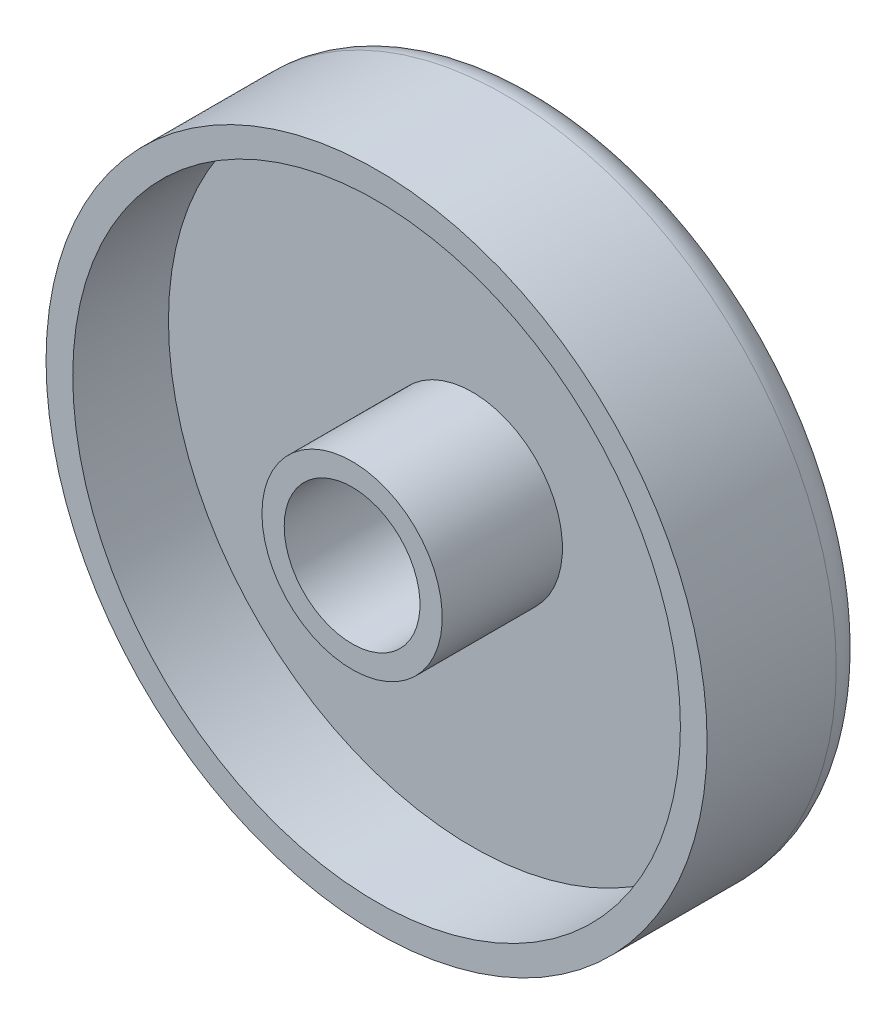
ISO-10303-21;
HEADER;
FILE_DESCRIPTION(('STEP AP214'),'2;1');
FILE_NAME('part.step','',(''),(''),'','','');
FILE_SCHEMA(('AUTOMOTIVE_DESIGN { 1 0 10303 214 1 1 1 1 }'));
ENDSEC;
DATA;
#1=APPLICATION_CONTEXT('core data for automotive mechanical design processes');
#2=APPLICATION_PROTOCOL_DEFINITION('international standard','automotive_design',2000,#1);
#3=PRODUCT_CONTEXT('',#1,'mechanical');
#4=PRODUCT('Part','Part','',(#3));
#5=PRODUCT_RELATED_PRODUCT_CATEGORY('part','',(#4));
#6=PRODUCT_DEFINITION_FORMATION('','',#4);
#7=PRODUCT_DEFINITION_CONTEXT('part definition',#1,'design');
#8=PRODUCT_DEFINITION('design','',#6,#7);
#9=PRODUCT_DEFINITION_SHAPE('','',#8);
#10=(LENGTH_UNIT() NAMED_UNIT(*) SI_UNIT(.MILLI.,.METRE.));
#11=(NAMED_UNIT(*) PLANE_ANGLE_UNIT() SI_UNIT($,.RADIAN.));
#12=(NAMED_UNIT(*) SI_UNIT($,.STERADIAN.) SOLID_ANGLE_UNIT());
#13=UNCERTAINTY_MEASURE_WITH_UNIT(LENGTH_MEASURE(1.E-05),#10,'distance_accuracy_value','');
#14=(GEOMETRIC_REPRESENTATION_CONTEXT(3) GLOBAL_UNCERTAINTY_ASSIGNED_CONTEXT((#13)) GLOBAL_UNIT_ASSIGNED_CONTEXT((#10,
#11,#12)) REPRESENTATION_CONTEXT('',''));
#15=CARTESIAN_POINT('',(0.,0.,0.));
#16=DIRECTION('',(0.,0.,1.));
#17=DIRECTION('',(1.,0.,0.));
#18=AXIS2_PLACEMENT_3D('',#15,#16,#17);
#19=CARTESIAN_POINT('',(0.,0.,7.3));
#20=DIRECTION('',(0.,0.,1.));
#21=DIRECTION('',(1.,0.,0.));
#22=AXIS2_PLACEMENT_3D('',#19,#20,#21);
#23=PLANE('',#22);
#24=CARTESIAN_POINT('',(0.,0.,7.3));
#25=DIRECTION('',(0.,0.,-1.));
#26=DIRECTION('',(1.,0.,0.));
#27=AXIS2_PLACEMENT_3D('',#24,#25,#26);
#28=CIRCLE('',#27,13.65);
#29=CARTESIAN_POINT('',(-13.65,0.,7.3));
#30=VERTEX_POINT('',#29);
#31=EDGE_CURVE('E20',#30,#30,#28,.T.);
#32=ORIENTED_EDGE('',*,*,#31,.T.);
#33=EDGE_LOOP('',(#32));
#34=FACE_BOUND('',#33,.T.);
#35=CARTESIAN_POINT('',(0.,0.,7.3));
#36=DIRECTION('',(0.,0.,1.));
#37=DIRECTION('',(1.,0.,0.));
#38=AXIS2_PLACEMENT_3D('',#35,#36,#37);
#39=CIRCLE('',#38,14.85);
#40=CARTESIAN_POINT('',(-14.85,0.,7.3));
#41=VERTEX_POINT('',#40);
#42=EDGE_CURVE('E110',#41,#41,#39,.T.);
#43=ORIENTED_EDGE('',*,*,#42,.T.);
#44=EDGE_LOOP('',(#43));
#45=FACE_BOUND('',#44,.T.);
#46=ADVANCED_FACE('F16',(#34,#45),#23,.T.);
#47=CARTESIAN_POINT('',(0.,0.,8.4));
#48=DIRECTION('',(0.,0.,1.));
#49=DIRECTION('',(1.,0.,0.));
#50=AXIS2_PLACEMENT_3D('',#47,#48,#49);
#51=PLANE('',#50);
#52=CARTESIAN_POINT('',(0.,0.,8.4));
#53=DIRECTION('',(0.,0.,-1.));
#54=DIRECTION('',(1.,0.,0.));
#55=AXIS2_PLACEMENT_3D('',#52,#53,#54);
#56=CIRCLE('',#55,3.05);
#57=CARTESIAN_POINT('',(-3.05,0.,8.4));
#58=VERTEX_POINT('',#57);
#59=EDGE_CURVE('E88',#58,#58,#56,.T.);
#60=ORIENTED_EDGE('',*,*,#59,.T.);
#61=EDGE_LOOP('',(#60));
#62=FACE_BOUND('',#61,.T.);
#63=CARTESIAN_POINT('',(0.,0.,8.4));
#64=DIRECTION('',(0.,0.,1.));
#65=DIRECTION('',(1.,0.,0.));
#66=AXIS2_PLACEMENT_3D('',#63,#64,#65);
#67=CIRCLE('',#66,4.05);
#68=CARTESIAN_POINT('',(-4.05,0.,8.4));
#69=VERTEX_POINT('',#68);
#70=EDGE_CURVE('E27',#69,#69,#67,.T.);
#71=ORIENTED_EDGE('',*,*,#70,.T.);
#72=EDGE_LOOP('',(#71));
#73=FACE_BOUND('',#72,.T.);
#74=ADVANCED_FACE('F160',(#62,#73),#51,.T.);
#75=CARTESIAN_POINT('',(0.,0.,0.));
#76=DIRECTION('',(0.,0.,1.));
#77=DIRECTION('',(1.,0.,0.));
#78=AXIS2_PLACEMENT_3D('',#75,#76,#77);
#79=CYLINDRICAL_SURFACE('',#78,4.05);
#80=ORIENTED_EDGE('',*,*,#70,.F.);
#81=DIRECTION('',(0.,0.,-1.));
#82=VECTOR('',#81,1.);
#83=CARTESIAN_POINT('',(-4.05,0.,0.));
#84=LINE('',#83,#82);
#85=CARTESIAN_POINT('',(-4.05,0.,3.));
#86=VERTEX_POINT('',#85);
#87=EDGE_CURVE('E11',#69,#86,#84,.T.);
#88=ORIENTED_EDGE('',*,*,#87,.T.);
#89=CARTESIAN_POINT('',(0.,0.,3.));
#90=DIRECTION('',(0.,0.,1.));
#91=DIRECTION('',(1.,0.,0.));
#92=AXIS2_PLACEMENT_3D('',#89,#90,#91);
#93=CIRCLE('',#92,4.05);
#94=EDGE_CURVE('E81',#86,#86,#93,.T.);
#95=ORIENTED_EDGE('',*,*,#94,.T.);
#96=ORIENTED_EDGE('',*,*,#87,.F.);
#97=EDGE_LOOP('',(#80,#88,#95,#96));
#98=FACE_BOUND('',#97,.T.);
#99=ADVANCED_FACE('F189',(#98),#79,.T.);
#100=CARTESIAN_POINT('',(0.,0.,2.6));
#101=DIRECTION('',(0.,0.,1.));
#102=DIRECTION('',(1.,0.,0.));
#103=AXIS2_PLACEMENT_3D('',#100,#101,#102);
#104=PLANE('',#103);
#105=CARTESIAN_POINT('',(0.,0.,2.6));
#106=DIRECTION('',(0.,0.,-1.));
#107=DIRECTION('',(1.,0.,0.));
#108=AXIS2_PLACEMENT_3D('',#105,#106,#107);
#109=CIRCLE('',#108,3.05);
#110=CARTESIAN_POINT('',(-3.05,0.,2.6));
#111=VERTEX_POINT('',#110);
#112=EDGE_CURVE('E276',#111,#111,#109,.T.);
#113=ORIENTED_EDGE('',*,*,#112,.F.);
#114=EDGE_LOOP('',(#113));
#115=FACE_BOUND('',#114,.T.);
#116=ADVANCED_FACE('F179',(#115),#104,.T.);
#117=CARTESIAN_POINT('',(0.,0.,8.4));
#118=DIRECTION('',(0.,0.,-1.));
#119=DIRECTION('',(1.,0.,0.));
#120=AXIS2_PLACEMENT_3D('',#117,#118,#119);
#121=CYLINDRICAL_SURFACE('',#120,3.05);
#122=ORIENTED_EDGE('',*,*,#59,.F.);
#123=DIRECTION('',(0.,0.,-1.));
#124=VECTOR('',#123,1.);
#125=CARTESIAN_POINT('',(-3.05,0.,8.4));
#126=LINE('',#125,#124);
#127=EDGE_CURVE('E127',#58,#111,#126,.T.);
#128=ORIENTED_EDGE('',*,*,#127,.T.);
#129=ORIENTED_EDGE('',*,*,#112,.T.);
#130=ORIENTED_EDGE('',*,*,#127,.F.);
#131=EDGE_LOOP('',(#122,#128,#129,#130));
#132=FACE_BOUND('',#131,.T.);
#133=ADVANCED_FACE('F173',(#132),#121,.F.);
#134=CARTESIAN_POINT('',(0.,0.,3.));
#135=DIRECTION('',(0.,0.,1.));
#136=DIRECTION('',(1.,0.,0.));
#137=AXIS2_PLACEMENT_3D('',#134,#135,#136);
#138=PLANE('',#137);
#139=ORIENTED_EDGE('',*,*,#94,.F.);
#140=EDGE_LOOP('',(#139));
#141=FACE_BOUND('',#140,.T.);
#142=CARTESIAN_POINT('',(0.,0.,3.));
#143=DIRECTION('',(0.,0.,-1.));
#144=DIRECTION('',(1.,0.,0.));
#145=AXIS2_PLACEMENT_3D('',#142,#143,#144);
#146=CIRCLE('',#145,13.65);
#147=CARTESIAN_POINT('',(-13.65,0.,3.));
#148=VERTEX_POINT('',#147);
#149=EDGE_CURVE('E74',#148,#148,#146,.T.);
#150=ORIENTED_EDGE('',*,*,#149,.F.);
#151=EDGE_LOOP('',(#150));
#152=FACE_BOUND('',#151,.T.);
#153=ADVANCED_FACE('F178',(#141,#152),#138,.T.);
#154=CARTESIAN_POINT('',(0.,0.,8.4));
#155=DIRECTION('',(0.,0.,-1.));
#156=DIRECTION('',(1.,0.,0.));
#157=AXIS2_PLACEMENT_3D('',#154,#155,#156);
#158=CYLINDRICAL_SURFACE('',#157,13.65);
#159=ORIENTED_EDGE('',*,*,#31,.F.);
#160=DIRECTION('',(0.,0.,-1.));
#161=VECTOR('',#160,1.);
#162=CARTESIAN_POINT('',(-13.65,0.,8.4));
#163=LINE('',#162,#161);
#164=EDGE_CURVE('E77',#30,#148,#163,.T.);
#165=ORIENTED_EDGE('',*,*,#164,.T.);
#166=ORIENTED_EDGE('',*,*,#149,.T.);
#167=ORIENTED_EDGE('',*,*,#164,.F.);
#168=EDGE_LOOP('',(#159,#165,#166,#167));
#169=FACE_BOUND('',#168,.T.);
#170=ADVANCED_FACE('F76',(#169),#158,.F.);
#171=CARTESIAN_POINT('',(0.,0.,1.3));
#172=DIRECTION('',(0.,0.,1.));
#173=DIRECTION('',(1.,0.,0.));
#174=AXIS2_PLACEMENT_3D('',#171,#172,#173);
#175=PLANE('',#174);
#176=CARTESIAN_POINT('',(0.,0.,1.3));
#177=DIRECTION('',(0.,0.,1.));
#178=DIRECTION('',(1.,0.,0.));
#179=AXIS2_PLACEMENT_3D('',#176,#177,#178);
#180=CIRCLE('',#179,9.75);
#181=CARTESIAN_POINT('',(-9.75,0.,1.3));
#182=VERTEX_POINT('',#181);
#183=EDGE_CURVE('E100',#182,#182,#180,.T.);
#184=ORIENTED_EDGE('',*,*,#183,.F.);
#185=EDGE_LOOP('',(#184));
#186=FACE_BOUND('',#185,.T.);
#187=ADVANCED_FACE('F225',(#186),#175,.F.);
#188=CARTESIAN_POINT('',(0.,0.,0.));
#189=DIRECTION('',(0.,0.,1.));
#190=DIRECTION('',(1.,0.,0.));
#191=AXIS2_PLACEMENT_3D('',#188,#189,#190);
#192=CYLINDRICAL_SURFACE('',#191,14.85);
#193=ORIENTED_EDGE('',*,*,#42,.F.);
#194=DIRECTION('',(0.,0.,-1.));
#195=VECTOR('',#194,1.);
#196=CARTESIAN_POINT('',(-14.85,0.,0.));
#197=LINE('',#196,#195);
#198=CARTESIAN_POINT('',(-14.85,0.,1.5));
#199=VERTEX_POINT('',#198);
#200=EDGE_CURVE('E118',#41,#199,#197,.T.);
#201=ORIENTED_EDGE('',*,*,#200,.T.);
#202=CARTESIAN_POINT('',(0.,0.,1.5));
#203=DIRECTION('',(0.,0.,-1.));
#204=DIRECTION('',(1.,0.,0.));
#205=AXIS2_PLACEMENT_3D('',#202,#203,#204);
#206=CIRCLE('',#205,14.85);
#207=EDGE_CURVE('E95',#199,#199,#206,.T.);
#208=ORIENTED_EDGE('',*,*,#207,.F.);
#209=ORIENTED_EDGE('',*,*,#200,.F.);
#210=EDGE_LOOP('',(#193,#201,#208,#209));
#211=FACE_BOUND('',#210,.T.);
#212=ADVANCED_FACE('F151',(#211),#192,.T.);
#213=CARTESIAN_POINT('',(0.,0.,1.5));
#214=DIRECTION('',(0.,0.,1.));
#215=DIRECTION('',(1.,0.,0.));
#216=AXIS2_PLACEMENT_3D('',#213,#214,#215);
#217=TOROIDAL_SURFACE('',#216,13.35,1.5);
#218=ORIENTED_EDGE('',*,*,#207,.T.);
#219=CARTESIAN_POINT('',(-13.35,0.,1.5));
#220=DIRECTION('',(0.,-1.,0.));
#221=DIRECTION('',(-1.,0.,0.));
#222=AXIS2_PLACEMENT_3D('',#219,#220,#221);
#223=CIRCLE('',#222,1.5);
#224=CARTESIAN_POINT('',(-13.35,0.,0.));
#225=VERTEX_POINT('',#224);
#226=EDGE_CURVE('E99',#199,#225,#223,.T.);
#227=ORIENTED_EDGE('',*,*,#226,.T.);
#228=CARTESIAN_POINT('',(0.,0.,0.));
#229=DIRECTION('',(0.,0.,1.));
#230=DIRECTION('',(1.,0.,0.));
#231=AXIS2_PLACEMENT_3D('',#228,#229,#230);
#232=CIRCLE('',#231,13.35);
#233=EDGE_CURVE('E93',#225,#225,#232,.T.);
#234=ORIENTED_EDGE('',*,*,#233,.T.);
#235=ORIENTED_EDGE('',*,*,#226,.F.);
#236=EDGE_LOOP('',(#218,#227,#234,#235));
#237=FACE_BOUND('',#236,.T.);
#238=ADVANCED_FACE('F18',(#237),#217,.T.);
#239=CARTESIAN_POINT('',(0.,0.,0.));
#240=DIRECTION('',(0.,0.,1.));
#241=DIRECTION('',(1.,0.,0.));
#242=AXIS2_PLACEMENT_3D('',#239,#240,#241);
#243=PLANE('',#242);
#244=CARTESIAN_POINT('',(0.,0.,0.));
#245=DIRECTION('',(0.,0.,-1.));
#246=DIRECTION('',(1.,0.,0.));
#247=AXIS2_PLACEMENT_3D('',#244,#245,#246);
#248=CIRCLE('',#247,12.75);
#249=CARTESIAN_POINT('',(-12.75,0.,0.));
#250=VERTEX_POINT('',#249);
#251=EDGE_CURVE('E105',#250,#250,#248,.T.);
#252=ORIENTED_EDGE('',*,*,#251,.F.);
#253=EDGE_LOOP('',(#252));
#254=FACE_BOUND('',#253,.T.);
#255=ORIENTED_EDGE('',*,*,#233,.F.);
#256=EDGE_LOOP('',(#255));
#257=FACE_BOUND('',#256,.T.);
#258=ADVANCED_FACE('F150',(#254,#257),#243,.F.);
#259=CARTESIAN_POINT('',(0.,0.,0.65));
#260=DIRECTION('',(0.,0.,-1.));
#261=DIRECTION('',(1.,0.,0.));
#262=AXIS2_PLACEMENT_3D('',#259,#260,#261);
#263=CONICAL_SURFACE('',#262,11.25,1.16188849784397);
#264=ORIENTED_EDGE('',*,*,#251,.T.);
#265=DIRECTION('',(0.917555625309924,0.,0.3976074376343));
#266=VECTOR('',#265,1.);
#267=CARTESIAN_POINT('',(-11.25,0.,0.65));
#268=LINE('',#267,#266);
#269=EDGE_CURVE('E103',#250,#182,#268,.T.);
#270=ORIENTED_EDGE('',*,*,#269,.T.);
#271=ORIENTED_EDGE('',*,*,#183,.T.);
#272=ORIENTED_EDGE('',*,*,#269,.F.);
#273=EDGE_LOOP('',(#264,#270,#271,#272));
#274=FACE_BOUND('',#273,.T.);
#275=ADVANCED_FACE('F133',(#274),#263,.F.);
#276=CLOSED_SHELL('',(#46,#74,#99,#116,#133,#153,#170,#187,#212,#238,#258,#275));
#277=MANIFOLD_SOLID_BREP('B1',#276);
#278=ADVANCED_BREP_SHAPE_REPRESENTATION('',(#18,#277),#14);
#279=SHAPE_DEFINITION_REPRESENTATION(#9,#278);
ENDSEC;
END-ISO-10303-21;
